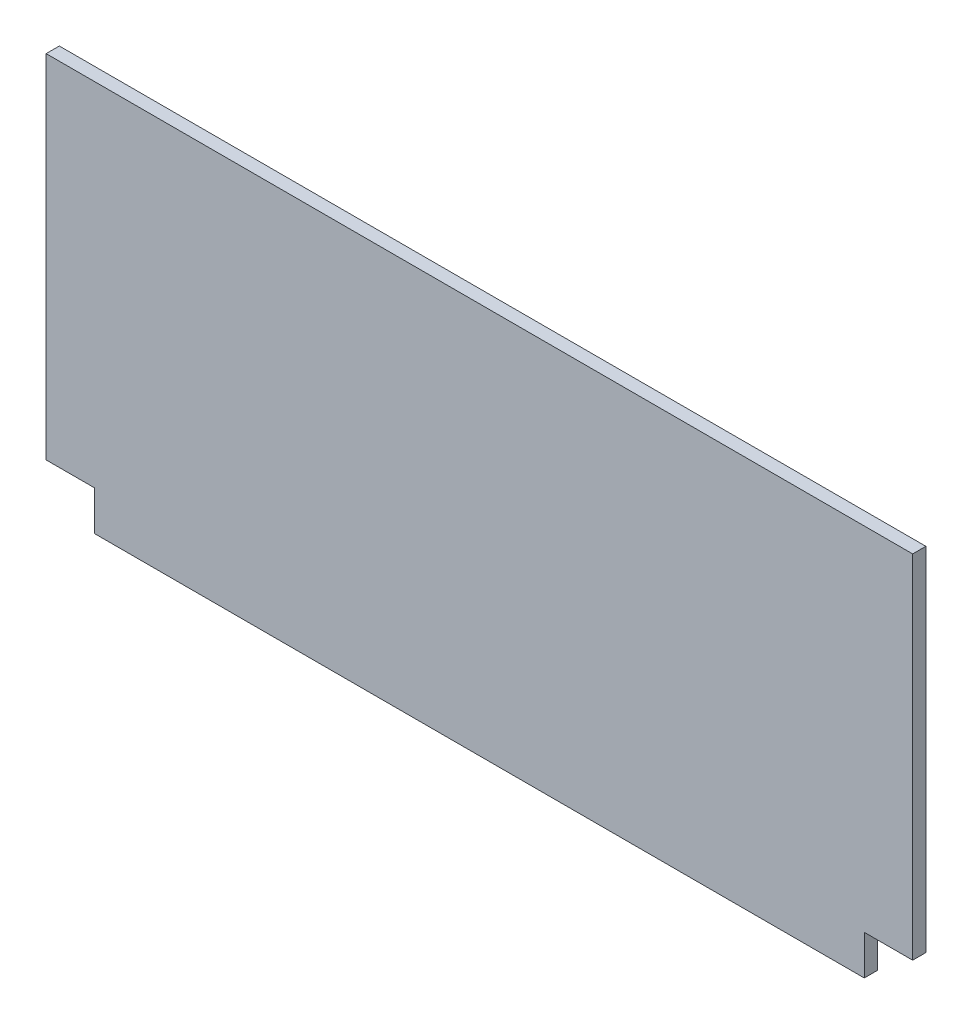
ISO-10303-21;
HEADER;
FILE_DESCRIPTION(('STEP AP214'),'2;1');
FILE_NAME('part.step','',(''),(''),'','','');
FILE_SCHEMA(('AUTOMOTIVE_DESIGN { 1 0 10303 214 1 1 1 1 }'));
ENDSEC;
DATA;
#1=APPLICATION_CONTEXT('core data for automotive mechanical design processes');
#2=APPLICATION_PROTOCOL_DEFINITION('international standard','automotive_design',2000,#1);
#3=PRODUCT_CONTEXT('',#1,'mechanical');
#4=PRODUCT('Part','Part','',(#3));
#5=PRODUCT_RELATED_PRODUCT_CATEGORY('part','',(#4));
#6=PRODUCT_DEFINITION_FORMATION('','',#4);
#7=PRODUCT_DEFINITION_CONTEXT('part definition',#1,'design');
#8=PRODUCT_DEFINITION('design','',#6,#7);
#9=PRODUCT_DEFINITION_SHAPE('','',#8);
#10=(LENGTH_UNIT() NAMED_UNIT(*) SI_UNIT(.MILLI.,.METRE.));
#11=(NAMED_UNIT(*) PLANE_ANGLE_UNIT() SI_UNIT($,.RADIAN.));
#12=(NAMED_UNIT(*) SI_UNIT($,.STERADIAN.) SOLID_ANGLE_UNIT());
#13=UNCERTAINTY_MEASURE_WITH_UNIT(LENGTH_MEASURE(1.E-05),#10,'distance_accuracy_value','');
#14=(GEOMETRIC_REPRESENTATION_CONTEXT(3) GLOBAL_UNCERTAINTY_ASSIGNED_CONTEXT((#13)) GLOBAL_UNIT_ASSIGNED_CONTEXT((#10,
#11,#12)) REPRESENTATION_CONTEXT('',''));
#15=CARTESIAN_POINT('',(0.,0.,0.));
#16=DIRECTION('',(0.,0.,1.));
#17=DIRECTION('',(1.,0.,0.));
#18=AXIS2_PLACEMENT_3D('',#15,#16,#17);
#19=CARTESIAN_POINT('',(0.,-44.5,3.));
#20=DIRECTION('',(0.,1.,0.));
#21=DIRECTION('',(-1.,0.,0.));
#22=AXIS2_PLACEMENT_3D('',#19,#20,#21);
#23=PLANE('',#22);
#24=DIRECTION('',(1.,0.,0.));
#25=VECTOR('',#24,1.);
#26=CARTESIAN_POINT('',(0.,-44.5,0.));
#27=LINE('',#26,#25);
#28=CARTESIAN_POINT('',(-87.5,-44.5,0.));
#29=VERTEX_POINT('',#28);
#30=CARTESIAN_POINT('',(87.5,-44.5,0.));
#31=VERTEX_POINT('',#30);
#32=EDGE_CURVE('E137',#29,#31,#27,.T.);
#33=ORIENTED_EDGE('',*,*,#32,.T.);
#34=DIRECTION('',(0.,0.,-1.));
#35=VECTOR('',#34,1.);
#36=CARTESIAN_POINT('',(87.5,-44.5,3.));
#37=LINE('',#36,#35);
#38=CARTESIAN_POINT('',(87.5,-44.5,3.));
#39=VERTEX_POINT('',#38);
#40=EDGE_CURVE('E11',#39,#31,#37,.T.);
#41=ORIENTED_EDGE('',*,*,#40,.F.);
#42=DIRECTION('',(1.,0.,0.));
#43=VECTOR('',#42,1.);
#44=CARTESIAN_POINT('',(0.,-44.5,3.));
#45=LINE('',#44,#43);
#46=CARTESIAN_POINT('',(-87.5,-44.5,3.));
#47=VERTEX_POINT('',#46);
#48=EDGE_CURVE('E157',#47,#39,#45,.T.);
#49=ORIENTED_EDGE('',*,*,#48,.F.);
#50=DIRECTION('',(0.,0.,-1.));
#51=VECTOR('',#50,1.);
#52=CARTESIAN_POINT('',(-87.5,-44.5,3.));
#53=LINE('',#52,#51);
#54=EDGE_CURVE('E55',#47,#29,#53,.T.);
#55=ORIENTED_EDGE('',*,*,#54,.T.);
#56=EDGE_LOOP('',(#33,#41,#49,#55));
#57=FACE_BOUND('',#56,.T.);
#58=ADVANCED_FACE('F39',(#57),#23,.F.);
#59=CARTESIAN_POINT('',(87.5,0.,3.));
#60=DIRECTION('',(-1.,0.,0.));
#61=DIRECTION('',(0.,0.,1.));
#62=AXIS2_PLACEMENT_3D('',#59,#60,#61);
#63=PLANE('',#62);
#64=DIRECTION('',(0.,1.,0.));
#65=VECTOR('',#64,1.);
#66=CARTESIAN_POINT('',(87.5,0.,0.));
#67=LINE('',#66,#65);
#68=CARTESIAN_POINT('',(87.5,-35.5,0.));
#69=VERTEX_POINT('',#68);
#70=EDGE_CURVE('E139',#31,#69,#67,.T.);
#71=ORIENTED_EDGE('',*,*,#70,.T.);
#72=DIRECTION('',(0.,0.,-1.));
#73=VECTOR('',#72,1.);
#74=CARTESIAN_POINT('',(87.5,-35.5,3.));
#75=LINE('',#74,#73);
#76=CARTESIAN_POINT('',(87.5,-35.5,3.));
#77=VERTEX_POINT('',#76);
#78=EDGE_CURVE('E47',#77,#69,#75,.T.);
#79=ORIENTED_EDGE('',*,*,#78,.F.);
#80=DIRECTION('',(0.,1.,0.));
#81=VECTOR('',#80,1.);
#82=CARTESIAN_POINT('',(87.5,0.,3.));
#83=LINE('',#82,#81);
#84=EDGE_CURVE('E94',#39,#77,#83,.T.);
#85=ORIENTED_EDGE('',*,*,#84,.F.);
#86=ORIENTED_EDGE('',*,*,#40,.T.);
#87=EDGE_LOOP('',(#71,#79,#85,#86));
#88=FACE_BOUND('',#87,.T.);
#89=ADVANCED_FACE('F170',(#88),#63,.F.);
#90=CARTESIAN_POINT('',(0.,-35.5,3.));
#91=DIRECTION('',(0.,-1.,0.));
#92=DIRECTION('',(0.,0.,-1.));
#93=AXIS2_PLACEMENT_3D('',#90,#91,#92);
#94=PLANE('',#93);
#95=DIRECTION('',(-1.,0.,0.));
#96=VECTOR('',#95,1.);
#97=CARTESIAN_POINT('',(0.,-35.5,0.));
#98=LINE('',#97,#96);
#99=CARTESIAN_POINT('',(98.5,-35.5,0.));
#100=VERTEX_POINT('',#99);
#101=EDGE_CURVE('E142',#100,#69,#98,.T.);
#102=ORIENTED_EDGE('',*,*,#101,.F.);
#103=DIRECTION('',(0.,0.,-1.));
#104=VECTOR('',#103,1.);
#105=CARTESIAN_POINT('',(98.5,-35.5,3.));
#106=LINE('',#105,#104);
#107=CARTESIAN_POINT('',(98.5,-35.5,3.));
#108=VERTEX_POINT('',#107);
#109=EDGE_CURVE('E163',#108,#100,#106,.T.);
#110=ORIENTED_EDGE('',*,*,#109,.F.);
#111=DIRECTION('',(-1.,0.,0.));
#112=VECTOR('',#111,1.);
#113=CARTESIAN_POINT('',(0.,-35.5,3.));
#114=LINE('',#113,#112);
#115=EDGE_CURVE('E169',#108,#77,#114,.T.);
#116=ORIENTED_EDGE('',*,*,#115,.T.);
#117=ORIENTED_EDGE('',*,*,#78,.T.);
#118=EDGE_LOOP('',(#102,#110,#116,#117));
#119=FACE_BOUND('',#118,.T.);
#120=ADVANCED_FACE('F167',(#119),#94,.T.);
#121=CARTESIAN_POINT('',(98.5,0.,3.));
#122=DIRECTION('',(-1.,0.,0.));
#123=DIRECTION('',(0.,0.,1.));
#124=AXIS2_PLACEMENT_3D('',#121,#122,#123);
#125=PLANE('',#124);
#126=DIRECTION('',(0.,1.,0.));
#127=VECTOR('',#126,1.);
#128=CARTESIAN_POINT('',(98.5,0.,0.));
#129=LINE('',#128,#127);
#130=CARTESIAN_POINT('',(98.5,44.5,0.));
#131=VERTEX_POINT('',#130);
#132=EDGE_CURVE('E145',#100,#131,#129,.T.);
#133=ORIENTED_EDGE('',*,*,#132,.T.);
#134=DIRECTION('',(0.,0.,-1.));
#135=VECTOR('',#134,1.);
#136=CARTESIAN_POINT('',(98.5,44.5,3.));
#137=LINE('',#136,#135);
#138=CARTESIAN_POINT('',(98.5,44.5,3.));
#139=VERTEX_POINT('',#138);
#140=EDGE_CURVE('E161',#139,#131,#137,.T.);
#141=ORIENTED_EDGE('',*,*,#140,.F.);
#142=DIRECTION('',(0.,1.,0.));
#143=VECTOR('',#142,1.);
#144=CARTESIAN_POINT('',(98.5,0.,3.));
#145=LINE('',#144,#143);
#146=EDGE_CURVE('E132',#108,#139,#145,.T.);
#147=ORIENTED_EDGE('',*,*,#146,.F.);
#148=ORIENTED_EDGE('',*,*,#109,.T.);
#149=EDGE_LOOP('',(#133,#141,#147,#148));
#150=FACE_BOUND('',#149,.T.);
#151=ADVANCED_FACE('F178',(#150),#125,.F.);
#152=CARTESIAN_POINT('',(0.,44.5,3.));
#153=DIRECTION('',(0.,1.,0.));
#154=DIRECTION('',(0.,0.,1.));
#155=AXIS2_PLACEMENT_3D('',#152,#153,#154);
#156=PLANE('',#155);
#157=DIRECTION('',(1.,0.,0.));
#158=VECTOR('',#157,1.);
#159=CARTESIAN_POINT('',(0.,44.5,0.));
#160=LINE('',#159,#158);
#161=CARTESIAN_POINT('',(-98.5,44.5,0.));
#162=VERTEX_POINT('',#161);
#163=EDGE_CURVE('E148',#162,#131,#160,.T.);
#164=ORIENTED_EDGE('',*,*,#163,.F.);
#165=DIRECTION('',(0.,0.,-1.));
#166=VECTOR('',#165,1.);
#167=CARTESIAN_POINT('',(-98.5,44.5,3.));
#168=LINE('',#167,#166);
#169=CARTESIAN_POINT('',(-98.5,44.5,3.));
#170=VERTEX_POINT('',#169);
#171=EDGE_CURVE('E119',#170,#162,#168,.T.);
#172=ORIENTED_EDGE('',*,*,#171,.F.);
#173=DIRECTION('',(1.,0.,0.));
#174=VECTOR('',#173,1.);
#175=CARTESIAN_POINT('',(0.,44.5,3.));
#176=LINE('',#175,#174);
#177=EDGE_CURVE('E130',#170,#139,#176,.T.);
#178=ORIENTED_EDGE('',*,*,#177,.T.);
#179=ORIENTED_EDGE('',*,*,#140,.T.);
#180=EDGE_LOOP('',(#164,#172,#178,#179));
#181=FACE_BOUND('',#180,.T.);
#182=ADVANCED_FACE('F204',(#181),#156,.T.);
#183=CARTESIAN_POINT('',(-98.5,0.,3.));
#184=DIRECTION('',(-1.,0.,0.));
#185=DIRECTION('',(0.,0.,1.));
#186=AXIS2_PLACEMENT_3D('',#183,#184,#185);
#187=PLANE('',#186);
#188=DIRECTION('',(0.,1.,0.));
#189=VECTOR('',#188,1.);
#190=CARTESIAN_POINT('',(-98.5,0.,0.));
#191=LINE('',#190,#189);
#192=CARTESIAN_POINT('',(-98.5,-35.5,0.));
#193=VERTEX_POINT('',#192);
#194=EDGE_CURVE('E116',#193,#162,#191,.T.);
#195=ORIENTED_EDGE('',*,*,#194,.F.);
#196=DIRECTION('',(0.,0.,-1.));
#197=VECTOR('',#196,1.);
#198=CARTESIAN_POINT('',(-98.5,-35.5,3.));
#199=LINE('',#198,#197);
#200=CARTESIAN_POINT('',(-98.5,-35.5,3.));
#201=VERTEX_POINT('',#200);
#202=EDGE_CURVE('E110',#201,#193,#199,.T.);
#203=ORIENTED_EDGE('',*,*,#202,.F.);
#204=DIRECTION('',(0.,1.,0.));
#205=VECTOR('',#204,1.);
#206=CARTESIAN_POINT('',(-98.5,0.,3.));
#207=LINE('',#206,#205);
#208=EDGE_CURVE('E114',#201,#170,#207,.T.);
#209=ORIENTED_EDGE('',*,*,#208,.T.);
#210=ORIENTED_EDGE('',*,*,#171,.T.);
#211=EDGE_LOOP('',(#195,#203,#209,#210));
#212=FACE_BOUND('',#211,.T.);
#213=ADVANCED_FACE('F112',(#212),#187,.T.);
#214=CARTESIAN_POINT('',(0.,-35.5,3.));
#215=DIRECTION('',(0.,1.,0.));
#216=DIRECTION('',(0.,0.,1.));
#217=AXIS2_PLACEMENT_3D('',#214,#215,#216);
#218=PLANE('',#217);
#219=DIRECTION('',(1.,0.,0.));
#220=VECTOR('',#219,1.);
#221=CARTESIAN_POINT('',(0.,-35.5,0.));
#222=LINE('',#221,#220);
#223=CARTESIAN_POINT('',(-87.5,-35.5,0.));
#224=VERTEX_POINT('',#223);
#225=EDGE_CURVE('E152',#193,#224,#222,.T.);
#226=ORIENTED_EDGE('',*,*,#225,.T.);
#227=DIRECTION('',(0.,0.,-1.));
#228=VECTOR('',#227,1.);
#229=CARTESIAN_POINT('',(-87.5,-35.5,3.));
#230=LINE('',#229,#228);
#231=CARTESIAN_POINT('',(-87.5,-35.5,3.));
#232=VERTEX_POINT('',#231);
#233=EDGE_CURVE('E82',#232,#224,#230,.T.);
#234=ORIENTED_EDGE('',*,*,#233,.F.);
#235=DIRECTION('',(1.,0.,0.));
#236=VECTOR('',#235,1.);
#237=CARTESIAN_POINT('',(0.,-35.5,3.));
#238=LINE('',#237,#236);
#239=EDGE_CURVE('E121',#201,#232,#238,.T.);
#240=ORIENTED_EDGE('',*,*,#239,.F.);
#241=ORIENTED_EDGE('',*,*,#202,.T.);
#242=EDGE_LOOP('',(#226,#234,#240,#241));
#243=FACE_BOUND('',#242,.T.);
#244=ADVANCED_FACE('F122',(#243),#218,.F.);
#245=CARTESIAN_POINT('',(-87.5,0.,3.));
#246=DIRECTION('',(-1.,0.,0.));
#247=DIRECTION('',(0.,0.,1.));
#248=AXIS2_PLACEMENT_3D('',#245,#246,#247);
#249=PLANE('',#248);
#250=DIRECTION('',(0.,1.,0.));
#251=VECTOR('',#250,1.);
#252=CARTESIAN_POINT('',(-87.5,0.,0.));
#253=LINE('',#252,#251);
#254=EDGE_CURVE('E154',#29,#224,#253,.T.);
#255=ORIENTED_EDGE('',*,*,#254,.F.);
#256=ORIENTED_EDGE('',*,*,#54,.F.);
#257=DIRECTION('',(0.,1.,0.));
#258=VECTOR('',#257,1.);
#259=CARTESIAN_POINT('',(-87.5,0.,3.));
#260=LINE('',#259,#258);
#261=EDGE_CURVE('E125',#47,#232,#260,.T.);
#262=ORIENTED_EDGE('',*,*,#261,.T.);
#263=ORIENTED_EDGE('',*,*,#233,.T.);
#264=EDGE_LOOP('',(#255,#256,#262,#263));
#265=FACE_BOUND('',#264,.T.);
#266=ADVANCED_FACE('F183',(#265),#249,.T.);
#267=CARTESIAN_POINT('',(0.,0.,3.));
#268=DIRECTION('',(0.,0.,1.));
#269=DIRECTION('',(1.,0.,0.));
#270=AXIS2_PLACEMENT_3D('',#267,#268,#269);
#271=PLANE('',#270);
#272=ORIENTED_EDGE('',*,*,#48,.T.);
#273=ORIENTED_EDGE('',*,*,#84,.T.);
#274=ORIENTED_EDGE('',*,*,#115,.F.);
#275=ORIENTED_EDGE('',*,*,#146,.T.);
#276=ORIENTED_EDGE('',*,*,#177,.F.);
#277=ORIENTED_EDGE('',*,*,#208,.F.);
#278=ORIENTED_EDGE('',*,*,#239,.T.);
#279=ORIENTED_EDGE('',*,*,#261,.F.);
#280=EDGE_LOOP('',(#272,#273,#274,#275,#276,#277,#278,#279));
#281=FACE_BOUND('',#280,.T.);
#282=ADVANCED_FACE('F128',(#281),#271,.T.);
#283=CARTESIAN_POINT('',(0.,0.,0.));
#284=DIRECTION('',(0.,0.,1.));
#285=DIRECTION('',(1.,0.,0.));
#286=AXIS2_PLACEMENT_3D('',#283,#284,#285);
#287=PLANE('',#286);
#288=ORIENTED_EDGE('',*,*,#32,.F.);
#289=ORIENTED_EDGE('',*,*,#254,.T.);
#290=ORIENTED_EDGE('',*,*,#225,.F.);
#291=ORIENTED_EDGE('',*,*,#194,.T.);
#292=ORIENTED_EDGE('',*,*,#163,.T.);
#293=ORIENTED_EDGE('',*,*,#132,.F.);
#294=ORIENTED_EDGE('',*,*,#101,.T.);
#295=ORIENTED_EDGE('',*,*,#70,.F.);
#296=EDGE_LOOP('',(#288,#289,#290,#291,#292,#293,#294,#295));
#297=FACE_BOUND('',#296,.T.);
#298=ADVANCED_FACE('F174',(#297),#287,.F.);
#299=CLOSED_SHELL('',(#58,#89,#120,#151,#182,#213,#244,#266,#282,#298));
#300=MANIFOLD_SOLID_BREP('B2',#299);
#301=ADVANCED_BREP_SHAPE_REPRESENTATION('',(#18,#300),#14);
#302=SHAPE_DEFINITION_REPRESENTATION(#9,#301);
ENDSEC;
END-ISO-10303-21;
